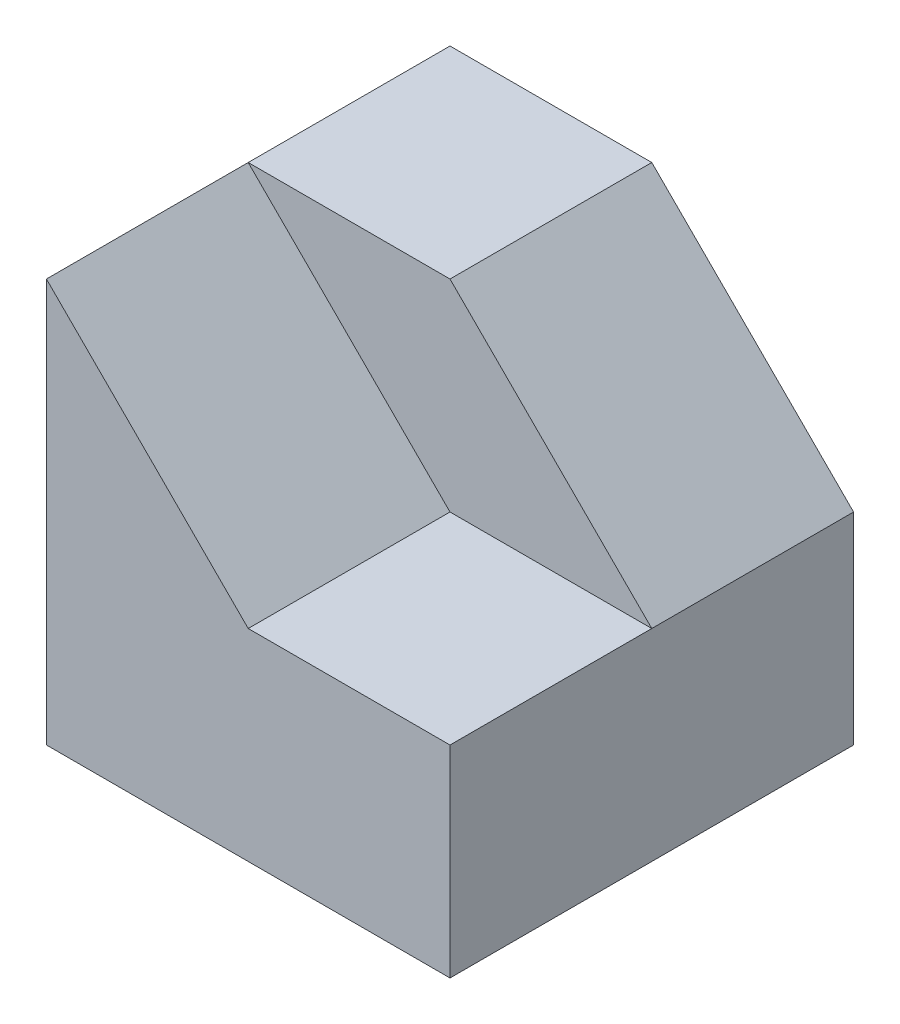
ISO-10303-21;
HEADER;
FILE_DESCRIPTION(('STEP AP214'),'2;1');
FILE_NAME('part.step','',(''),(''),'','','');
FILE_SCHEMA(('AUTOMOTIVE_DESIGN { 1 0 10303 214 1 1 1 1 }'));
ENDSEC;
DATA;
#1=APPLICATION_CONTEXT('core data for automotive mechanical design processes');
#2=APPLICATION_PROTOCOL_DEFINITION('international standard','automotive_design',2000,#1);
#3=PRODUCT_CONTEXT('',#1,'mechanical');
#4=PRODUCT('Part','Part','',(#3));
#5=PRODUCT_RELATED_PRODUCT_CATEGORY('part','',(#4));
#6=PRODUCT_DEFINITION_FORMATION('','',#4);
#7=PRODUCT_DEFINITION_CONTEXT('part definition',#1,'design');
#8=PRODUCT_DEFINITION('design','',#6,#7);
#9=PRODUCT_DEFINITION_SHAPE('','',#8);
#10=(LENGTH_UNIT() NAMED_UNIT(*) SI_UNIT(.MILLI.,.METRE.));
#11=(NAMED_UNIT(*) PLANE_ANGLE_UNIT() SI_UNIT($,.RADIAN.));
#12=(NAMED_UNIT(*) SI_UNIT($,.STERADIAN.) SOLID_ANGLE_UNIT());
#13=UNCERTAINTY_MEASURE_WITH_UNIT(LENGTH_MEASURE(1.E-05),#10,'distance_accuracy_value','');
#14=(GEOMETRIC_REPRESENTATION_CONTEXT(3) GLOBAL_UNCERTAINTY_ASSIGNED_CONTEXT((#13)) GLOBAL_UNIT_ASSIGNED_CONTEXT((#10,
#11,#12)) REPRESENTATION_CONTEXT('',''));
#15=CARTESIAN_POINT('',(0.,0.,0.));
#16=DIRECTION('',(0.,0.,1.));
#17=DIRECTION('',(1.,0.,0.));
#18=AXIS2_PLACEMENT_3D('',#15,#16,#17);
#19=CARTESIAN_POINT('',(0.,60.,0.));
#20=DIRECTION('',(1.,0.,0.));
#21=DIRECTION('',(0.,0.,-1.));
#22=AXIS2_PLACEMENT_3D('',#19,#20,#21);
#23=PLANE('',#22);
#24=DIRECTION('',(0.,0.,1.));
#25=VECTOR('',#24,1.);
#26=CARTESIAN_POINT('',(0.,0.,0.));
#27=LINE('',#26,#25);
#28=CARTESIAN_POINT('',(0.,0.,0.));
#29=VERTEX_POINT('',#28);
#30=CARTESIAN_POINT('',(0.,0.,60.));
#31=VERTEX_POINT('',#30);
#32=EDGE_CURVE('E99',#29,#31,#27,.T.);
#33=ORIENTED_EDGE('',*,*,#32,.T.);
#34=DIRECTION('',(0.,-1.,0.));
#35=VECTOR('',#34,1.);
#36=CARTESIAN_POINT('',(0.,60.,60.));
#37=LINE('',#36,#35);
#38=CARTESIAN_POINT('',(0.,60.,60.));
#39=VERTEX_POINT('',#38);
#40=EDGE_CURVE('E11',#39,#31,#37,.T.);
#41=ORIENTED_EDGE('',*,*,#40,.F.);
#42=DIRECTION('',(0.,0.,1.));
#43=VECTOR('',#42,1.);
#44=CARTESIAN_POINT('',(0.,60.,30.));
#45=LINE('',#44,#43);
#46=CARTESIAN_POINT('',(0.,60.,30.));
#47=VERTEX_POINT('',#46);
#48=EDGE_CURVE('E170',#47,#39,#45,.T.);
#49=ORIENTED_EDGE('',*,*,#48,.F.);
#50=DIRECTION('',(0.,0.,1.));
#51=VECTOR('',#50,1.);
#52=CARTESIAN_POINT('',(0.,60.,0.));
#53=LINE('',#52,#51);
#54=CARTESIAN_POINT('',(0.,60.,0.));
#55=VERTEX_POINT('',#54);
#56=EDGE_CURVE('E101',#55,#47,#53,.T.);
#57=ORIENTED_EDGE('',*,*,#56,.F.);
#58=DIRECTION('',(0.,-1.,0.));
#59=VECTOR('',#58,1.);
#60=CARTESIAN_POINT('',(0.,60.,0.));
#61=LINE('',#60,#59);
#62=EDGE_CURVE('E84',#55,#29,#61,.T.);
#63=ORIENTED_EDGE('',*,*,#62,.T.);
#64=EDGE_LOOP('',(#33,#41,#49,#57,#63));
#65=FACE_BOUND('',#64,.T.);
#66=ADVANCED_FACE('F39',(#65),#23,.F.);
#67=CARTESIAN_POINT('',(0.,60.,60.));
#68=DIRECTION('',(0.,0.,-1.));
#69=DIRECTION('',(-1.,0.,0.));
#70=AXIS2_PLACEMENT_3D('',#67,#68,#69);
#71=PLANE('',#70);
#72=DIRECTION('',(1.,0.,0.));
#73=VECTOR('',#72,1.);
#74=CARTESIAN_POINT('',(60.,30.,60.));
#75=LINE('',#74,#73);
#76=CARTESIAN_POINT('',(30.,30.,60.));
#77=VERTEX_POINT('',#76);
#78=CARTESIAN_POINT('',(60.,30.,60.));
#79=VERTEX_POINT('',#78);
#80=EDGE_CURVE('E114',#77,#79,#75,.T.);
#81=ORIENTED_EDGE('',*,*,#80,.F.);
#82=DIRECTION('',(0.707106781186547,-0.707106781186547,0.));
#83=VECTOR('',#82,1.);
#84=CARTESIAN_POINT('',(0.,60.,60.));
#85=LINE('',#84,#83);
#86=EDGE_CURVE('E123',#39,#77,#85,.T.);
#87=ORIENTED_EDGE('',*,*,#86,.F.);
#88=ORIENTED_EDGE('',*,*,#40,.T.);
#89=DIRECTION('',(1.,0.,0.));
#90=VECTOR('',#89,1.);
#91=CARTESIAN_POINT('',(0.,0.,60.));
#92=LINE('',#91,#90);
#93=CARTESIAN_POINT('',(60.,0.,60.));
#94=VERTEX_POINT('',#93);
#95=EDGE_CURVE('E94',#31,#94,#92,.T.);
#96=ORIENTED_EDGE('',*,*,#95,.T.);
#97=DIRECTION('',(0.,-1.,0.));
#98=VECTOR('',#97,1.);
#99=CARTESIAN_POINT('',(60.,60.,60.));
#100=LINE('',#99,#98);
#101=EDGE_CURVE('E48',#79,#94,#100,.T.);
#102=ORIENTED_EDGE('',*,*,#101,.F.);
#103=EDGE_LOOP('',(#81,#87,#88,#96,#102));
#104=FACE_BOUND('',#103,.T.);
#105=ADVANCED_FACE('F118',(#104),#71,.F.);
#106=CARTESIAN_POINT('',(60.,60.,0.));
#107=DIRECTION('',(-1.,0.,0.));
#108=DIRECTION('',(0.,0.,1.));
#109=AXIS2_PLACEMENT_3D('',#106,#107,#108);
#110=PLANE('',#109);
#111=DIRECTION('',(0.,-1.,0.));
#112=VECTOR('',#111,1.);
#113=CARTESIAN_POINT('',(60.,60.,0.));
#114=LINE('',#113,#112);
#115=CARTESIAN_POINT('',(60.,30.,0.));
#116=VERTEX_POINT('',#115);
#117=CARTESIAN_POINT('',(60.,0.,0.));
#118=VERTEX_POINT('',#117);
#119=EDGE_CURVE('E72',#116,#118,#114,.T.);
#120=ORIENTED_EDGE('',*,*,#119,.F.);
#121=DIRECTION('',(0.,0.,1.));
#122=VECTOR('',#121,1.);
#123=CARTESIAN_POINT('',(60.,30.,0.));
#124=LINE('',#123,#122);
#125=CARTESIAN_POINT('',(60.,30.,30.));
#126=VERTEX_POINT('',#125);
#127=EDGE_CURVE('E152',#116,#126,#124,.T.);
#128=ORIENTED_EDGE('',*,*,#127,.T.);
#129=DIRECTION('',(0.,0.,-1.));
#130=VECTOR('',#129,1.);
#131=CARTESIAN_POINT('',(60.,30.,60.));
#132=LINE('',#131,#130);
#133=EDGE_CURVE('E149',#79,#126,#132,.T.);
#134=ORIENTED_EDGE('',*,*,#133,.F.);
#135=ORIENTED_EDGE('',*,*,#101,.T.);
#136=DIRECTION('',(0.,0.,-1.));
#137=VECTOR('',#136,1.);
#138=CARTESIAN_POINT('',(60.,0.,0.));
#139=LINE('',#138,#137);
#140=EDGE_CURVE('E87',#94,#118,#139,.T.);
#141=ORIENTED_EDGE('',*,*,#140,.T.);
#142=EDGE_LOOP('',(#120,#128,#134,#135,#141));
#143=FACE_BOUND('',#142,.T.);
#144=ADVANCED_FACE('F88',(#143),#110,.F.);
#145=CARTESIAN_POINT('',(0.,60.,0.));
#146=DIRECTION('',(0.,0.,1.));
#147=DIRECTION('',(1.,0.,0.));
#148=AXIS2_PLACEMENT_3D('',#145,#146,#147);
#149=PLANE('',#148);
#150=DIRECTION('',(-1.,0.,0.));
#151=VECTOR('',#150,1.);
#152=CARTESIAN_POINT('',(0.,60.,0.));
#153=LINE('',#152,#151);
#154=CARTESIAN_POINT('',(30.,60.,0.));
#155=VERTEX_POINT('',#154);
#156=EDGE_CURVE('E55',#155,#55,#153,.T.);
#157=ORIENTED_EDGE('',*,*,#156,.F.);
#158=DIRECTION('',(0.707106781186547,-0.707106781186547,0.));
#159=VECTOR('',#158,1.);
#160=CARTESIAN_POINT('',(30.,60.,0.));
#161=LINE('',#160,#159);
#162=EDGE_CURVE('E80',#155,#116,#161,.T.);
#163=ORIENTED_EDGE('',*,*,#162,.T.);
#164=ORIENTED_EDGE('',*,*,#119,.T.);
#165=DIRECTION('',(-1.,0.,0.));
#166=VECTOR('',#165,1.);
#167=CARTESIAN_POINT('',(0.,0.,0.));
#168=LINE('',#167,#166);
#169=EDGE_CURVE('E76',#118,#29,#168,.T.);
#170=ORIENTED_EDGE('',*,*,#169,.T.);
#171=ORIENTED_EDGE('',*,*,#62,.F.);
#172=EDGE_LOOP('',(#157,#163,#164,#170,#171));
#173=FACE_BOUND('',#172,.T.);
#174=ADVANCED_FACE('F74',(#173),#149,.F.);
#175=CARTESIAN_POINT('',(0.,60.,0.));
#176=DIRECTION('',(0.,1.,0.));
#177=DIRECTION('',(0.,0.,1.));
#178=AXIS2_PLACEMENT_3D('',#175,#176,#177);
#179=PLANE('',#178);
#180=DIRECTION('',(-1.,0.,0.));
#181=VECTOR('',#180,1.);
#182=CARTESIAN_POINT('',(30.,60.,30.));
#183=LINE('',#182,#181);
#184=CARTESIAN_POINT('',(30.,60.,30.));
#185=VERTEX_POINT('',#184);
#186=EDGE_CURVE('E178',#185,#47,#183,.T.);
#187=ORIENTED_EDGE('',*,*,#186,.F.);
#188=DIRECTION('',(0.,0.,1.));
#189=VECTOR('',#188,1.);
#190=CARTESIAN_POINT('',(30.,60.,0.));
#191=LINE('',#190,#189);
#192=EDGE_CURVE('E160',#155,#185,#191,.T.);
#193=ORIENTED_EDGE('',*,*,#192,.F.);
#194=ORIENTED_EDGE('',*,*,#156,.T.);
#195=ORIENTED_EDGE('',*,*,#56,.T.);
#196=EDGE_LOOP('',(#187,#193,#194,#195));
#197=FACE_BOUND('',#196,.T.);
#198=ADVANCED_FACE('F192',(#197),#179,.T.);
#199=CARTESIAN_POINT('',(0.,0.,0.));
#200=DIRECTION('',(0.,1.,0.));
#201=DIRECTION('',(0.,0.,1.));
#202=AXIS2_PLACEMENT_3D('',#199,#200,#201);
#203=PLANE('',#202);
#204=ORIENTED_EDGE('',*,*,#32,.F.);
#205=ORIENTED_EDGE('',*,*,#169,.F.);
#206=ORIENTED_EDGE('',*,*,#140,.F.);
#207=ORIENTED_EDGE('',*,*,#95,.F.);
#208=EDGE_LOOP('',(#204,#205,#206,#207));
#209=FACE_BOUND('',#208,.T.);
#210=ADVANCED_FACE('F97',(#209),#203,.F.);
#211=CARTESIAN_POINT('',(60.,30.,30.));
#212=DIRECTION('',(0.,0.,-1.));
#213=DIRECTION('',(-1.,0.,0.));
#214=AXIS2_PLACEMENT_3D('',#211,#212,#213);
#215=PLANE('',#214);
#216=DIRECTION('',(-1.,0.,0.));
#217=VECTOR('',#216,1.);
#218=CARTESIAN_POINT('',(60.,30.,30.));
#219=LINE('',#218,#217);
#220=CARTESIAN_POINT('',(30.,30.,30.));
#221=VERTEX_POINT('',#220);
#222=EDGE_CURVE('E155',#126,#221,#219,.T.);
#223=ORIENTED_EDGE('',*,*,#222,.F.);
#224=DIRECTION('',(0.707106781186547,-0.707106781186547,0.));
#225=VECTOR('',#224,1.);
#226=CARTESIAN_POINT('',(30.,60.,30.));
#227=LINE('',#226,#225);
#228=EDGE_CURVE('E167',#185,#126,#227,.T.);
#229=ORIENTED_EDGE('',*,*,#228,.F.);
#230=ORIENTED_EDGE('',*,*,#186,.T.);
#231=DIRECTION('',(0.707106781186547,-0.707106781186547,0.));
#232=VECTOR('',#231,1.);
#233=CARTESIAN_POINT('',(0.,60.,30.));
#234=LINE('',#233,#232);
#235=EDGE_CURVE('E175',#47,#221,#234,.T.);
#236=ORIENTED_EDGE('',*,*,#235,.T.);
#237=EDGE_LOOP('',(#223,#229,#230,#236));
#238=FACE_BOUND('',#237,.T.);
#239=ADVANCED_FACE('F188',(#238),#215,.F.);
#240=CARTESIAN_POINT('',(0.,30.,0.));
#241=DIRECTION('',(0.,1.,0.));
#242=DIRECTION('',(0.,0.,1.));
#243=AXIS2_PLACEMENT_3D('',#240,#241,#242);
#244=PLANE('',#243);
#245=ORIENTED_EDGE('',*,*,#133,.T.);
#246=ORIENTED_EDGE('',*,*,#222,.T.);
#247=DIRECTION('',(0.,0.,1.));
#248=VECTOR('',#247,1.);
#249=CARTESIAN_POINT('',(30.,30.,60.));
#250=LINE('',#249,#248);
#251=EDGE_CURVE('E150',#221,#77,#250,.T.);
#252=ORIENTED_EDGE('',*,*,#251,.T.);
#253=ORIENTED_EDGE('',*,*,#80,.T.);
#254=EDGE_LOOP('',(#245,#246,#252,#253));
#255=FACE_BOUND('',#254,.T.);
#256=ADVANCED_FACE('F147',(#255),#244,.T.);
#257=CARTESIAN_POINT('',(30.,60.,0.));
#258=DIRECTION('',(-0.707106781186547,-0.707106781186547,0.));
#259=DIRECTION('',(0.707106781186548,-0.707106781186548,0.));
#260=AXIS2_PLACEMENT_3D('',#257,#258,#259);
#261=PLANE('',#260);
#262=ORIENTED_EDGE('',*,*,#228,.T.);
#263=ORIENTED_EDGE('',*,*,#127,.F.);
#264=ORIENTED_EDGE('',*,*,#162,.F.);
#265=ORIENTED_EDGE('',*,*,#192,.T.);
#266=EDGE_LOOP('',(#262,#263,#264,#265));
#267=FACE_BOUND('',#266,.T.);
#268=ADVANCED_FACE('F249',(#267),#261,.F.);
#269=CARTESIAN_POINT('',(0.,60.,30.));
#270=DIRECTION('',(-0.707106781186547,-0.707106781186547,0.));
#271=DIRECTION('',(0.707106781186548,-0.707106781186548,0.));
#272=AXIS2_PLACEMENT_3D('',#269,#270,#271);
#273=PLANE('',#272);
#274=ORIENTED_EDGE('',*,*,#86,.T.);
#275=ORIENTED_EDGE('',*,*,#251,.F.);
#276=ORIENTED_EDGE('',*,*,#235,.F.);
#277=ORIENTED_EDGE('',*,*,#48,.T.);
#278=EDGE_LOOP('',(#274,#275,#276,#277));
#279=FACE_BOUND('',#278,.T.);
#280=ADVANCED_FACE('F257',(#279),#273,.F.);
#281=CLOSED_SHELL('',(#66,#105,#144,#174,#198,#210,#239,#256,#268,#280));
#282=MANIFOLD_SOLID_BREP('B2',#281);
#283=ADVANCED_BREP_SHAPE_REPRESENTATION('',(#18,#282),#14);
#284=SHAPE_DEFINITION_REPRESENTATION(#9,#283);
ENDSEC;
END-ISO-10303-21;
